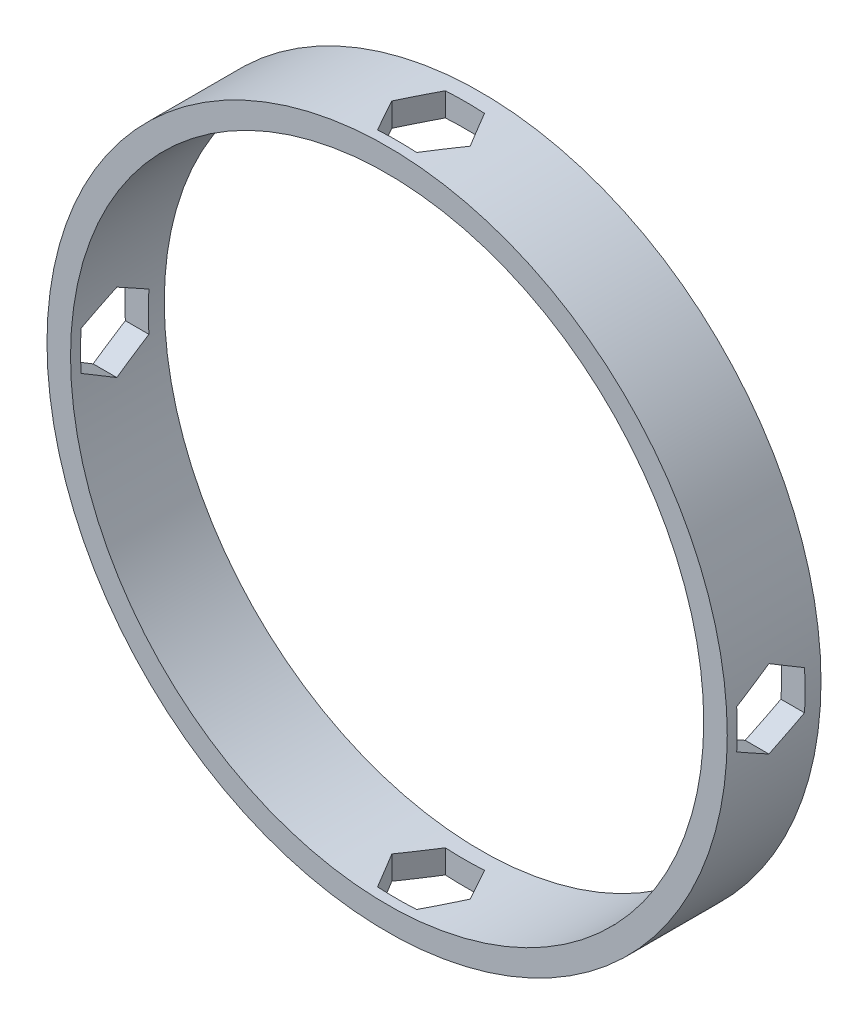
ISO-10303-21;
HEADER;
FILE_DESCRIPTION(('STEP AP214'),'2;1');
FILE_NAME('part.step','',(''),(''),'','','');
FILE_SCHEMA(('AUTOMOTIVE_DESIGN { 1 0 10303 214 1 1 1 1 }'));
ENDSEC;
DATA;
#1=APPLICATION_CONTEXT('core data for automotive mechanical design processes');
#2=APPLICATION_PROTOCOL_DEFINITION('international standard','automotive_design',2000,#1);
#3=PRODUCT_CONTEXT('',#1,'mechanical');
#4=PRODUCT('Part','Part','',(#3));
#5=PRODUCT_RELATED_PRODUCT_CATEGORY('part','',(#4));
#6=PRODUCT_DEFINITION_FORMATION('','',#4);
#7=PRODUCT_DEFINITION_CONTEXT('part definition',#1,'design');
#8=PRODUCT_DEFINITION('design','',#6,#7);
#9=PRODUCT_DEFINITION_SHAPE('','',#8);
#10=(LENGTH_UNIT() NAMED_UNIT(*) SI_UNIT(.MILLI.,.METRE.));
#11=(NAMED_UNIT(*) PLANE_ANGLE_UNIT() SI_UNIT($,.RADIAN.));
#12=(NAMED_UNIT(*) SI_UNIT($,.STERADIAN.) SOLID_ANGLE_UNIT());
#13=UNCERTAINTY_MEASURE_WITH_UNIT(LENGTH_MEASURE(1.E-05),#10,'distance_accuracy_value','');
#14=(GEOMETRIC_REPRESENTATION_CONTEXT(3) GLOBAL_UNCERTAINTY_ASSIGNED_CONTEXT((#13)) GLOBAL_UNIT_ASSIGNED_CONTEXT((#10,
#11,#12)) REPRESENTATION_CONTEXT('',''));
#15=CARTESIAN_POINT('',(0.,0.,0.));
#16=DIRECTION('',(0.,0.,1.));
#17=DIRECTION('',(1.,0.,0.));
#18=AXIS2_PLACEMENT_3D('',#15,#16,#17);
#19=CARTESIAN_POINT('',(0.,0.,9.4));
#20=DIRECTION('',(0.,0.,1.));
#21=DIRECTION('',(1.,0.,0.));
#22=AXIS2_PLACEMENT_3D('',#19,#20,#21);
#23=PLANE('',#22);
#24=CARTESIAN_POINT('',(0.,0.,9.4));
#25=DIRECTION('',(0.,0.,1.));
#26=DIRECTION('',(1.,0.,0.));
#27=AXIS2_PLACEMENT_3D('',#24,#25,#26);
#28=CIRCLE('',#27,34.11);
#29=CARTESIAN_POINT('',(34.11,0.,9.4));
#30=VERTEX_POINT('',#29);
#31=EDGE_CURVE('E332',#30,#30,#28,.T.);
#32=ORIENTED_EDGE('',*,*,#31,.T.);
#33=EDGE_LOOP('',(#32));
#34=FACE_BOUND('',#33,.T.);
#35=CARTESIAN_POINT('',(0.,0.,9.4));
#36=DIRECTION('',(0.,0.,1.));
#37=DIRECTION('',(1.,0.,0.));
#38=AXIS2_PLACEMENT_3D('',#35,#36,#37);
#39=CIRCLE('',#38,31.75);
#40=CARTESIAN_POINT('',(31.75,0.,9.4));
#41=VERTEX_POINT('',#40);
#42=EDGE_CURVE('E325',#41,#41,#39,.T.);
#43=ORIENTED_EDGE('',*,*,#42,.F.);
#44=EDGE_LOOP('',(#43));
#45=FACE_BOUND('',#44,.T.);
#46=ADVANCED_FACE('F43',(#34,#45),#23,.T.);
#47=CARTESIAN_POINT('',(0.,0.,0.));
#48=DIRECTION('',(0.,0.,1.));
#49=DIRECTION('',(1.,0.,0.));
#50=AXIS2_PLACEMENT_3D('',#47,#48,#49);
#51=PLANE('',#50);
#52=CARTESIAN_POINT('',(0.,0.,0.));
#53=DIRECTION('',(0.,0.,1.));
#54=DIRECTION('',(1.,0.,0.));
#55=AXIS2_PLACEMENT_3D('',#52,#53,#54);
#56=CIRCLE('',#55,34.11);
#57=CARTESIAN_POINT('',(34.11,0.,0.));
#58=VERTEX_POINT('',#57);
#59=EDGE_CURVE('E328',#58,#58,#56,.T.);
#60=ORIENTED_EDGE('',*,*,#59,.F.);
#61=EDGE_LOOP('',(#60));
#62=FACE_BOUND('',#61,.T.);
#63=CARTESIAN_POINT('',(0.,0.,0.));
#64=DIRECTION('',(0.,0.,1.));
#65=DIRECTION('',(1.,0.,0.));
#66=AXIS2_PLACEMENT_3D('',#63,#64,#65);
#67=CIRCLE('',#66,31.75);
#68=CARTESIAN_POINT('',(31.75,0.,0.));
#69=VERTEX_POINT('',#68);
#70=EDGE_CURVE('E329',#69,#69,#67,.T.);
#71=ORIENTED_EDGE('',*,*,#70,.T.);
#72=EDGE_LOOP('',(#71));
#73=FACE_BOUND('',#72,.T.);
#74=ADVANCED_FACE('F391',(#62,#73),#51,.F.);
#75=CARTESIAN_POINT('',(0.,0.,9.4));
#76=DIRECTION('',(0.,0.,-1.));
#77=DIRECTION('',(-1.,0.,0.));
#78=AXIS2_PLACEMENT_3D('',#75,#76,#77);
#79=CYLINDRICAL_SURFACE('',#78,34.11);
#80=CARTESIAN_POINT('',(0.,0.,11.8));
#81=DIRECTION('',(0.,0.866025403784438,0.5));
#82=DIRECTION('',(0.,0.5,-0.866025403784439));
#83=AXIS2_PLACEMENT_3D('',#80,#81,#82);
#84=ELLIPSE('',#83,68.22,34.11);
#85=CARTESIAN_POINT('',(34.053469231,1.96299091524485,8.4));
#86=VERTEX_POINT('',#85);
#87=CARTESIAN_POINT('',(33.8833110345885,3.92598183048957,5.00000000000002));
#88=VERTEX_POINT('',#87);
#89=EDGE_CURVE('E212',#86,#88,#84,.T.);
#90=ORIENTED_EDGE('',*,*,#89,.T.);
#91=CARTESIAN_POINT('',(0.,0.,-1.79999999999999));
#92=DIRECTION('',(0.,0.866025403784438,-0.500000000000001));
#93=DIRECTION('',(0.,-0.500000000000001,-0.866025403784438));
#94=AXIS2_PLACEMENT_3D('',#91,#92,#93);
#95=ELLIPSE('',#94,68.2199999999999,34.11);
#96=CARTESIAN_POINT('',(34.053469231,1.96299091524484,1.6));
#97=VERTEX_POINT('',#96);
#98=EDGE_CURVE('E59',#88,#97,#95,.T.);
#99=ORIENTED_EDGE('',*,*,#98,.T.);
#100=CARTESIAN_POINT('',(0.,0.,1.6));
#101=DIRECTION('',(0.,0.,-1.));
#102=DIRECTION('',(0.,-1.,0.));
#103=AXIS2_PLACEMENT_3D('',#100,#101,#102);
#104=CIRCLE('',#103,34.11);
#105=CARTESIAN_POINT('',(34.0534692310001,-1.96299091524461,1.6));
#106=VERTEX_POINT('',#105);
#107=EDGE_CURVE('E225',#97,#106,#104,.T.);
#108=ORIENTED_EDGE('',*,*,#107,.T.);
#109=CARTESIAN_POINT('',(0.,0.,-1.8));
#110=DIRECTION('',(0.,-0.866025403784439,-0.5));
#111=DIRECTION('',(0.,0.5,-0.866025403784439));
#112=AXIS2_PLACEMENT_3D('',#109,#110,#111);
#113=ELLIPSE('',#112,68.22,34.11);
#114=CARTESIAN_POINT('',(33.8833110345885,-3.92598183048934,5.));
#115=VERTEX_POINT('',#114);
#116=EDGE_CURVE('E687',#106,#115,#113,.T.);
#117=ORIENTED_EDGE('',*,*,#116,.T.);
#118=CARTESIAN_POINT('',(0.,0.,11.8));
#119=DIRECTION('',(0.,-0.866025403784439,0.5));
#120=DIRECTION('',(0.,-0.5,-0.866025403784439));
#121=AXIS2_PLACEMENT_3D('',#118,#119,#120);
#122=ELLIPSE('',#121,68.22,34.11);
#123=CARTESIAN_POINT('',(34.0534692310001,-1.96299091524461,8.4));
#124=VERTEX_POINT('',#123);
#125=EDGE_CURVE('E676',#115,#124,#122,.T.);
#126=ORIENTED_EDGE('',*,*,#125,.T.);
#127=CARTESIAN_POINT('',(0.,0.,8.4));
#128=DIRECTION('',(0.,0.,1.));
#129=DIRECTION('',(0.,1.,0.));
#130=AXIS2_PLACEMENT_3D('',#127,#128,#129);
#131=CIRCLE('',#130,34.11);
#132=EDGE_CURVE('E668',#124,#86,#131,.T.);
#133=ORIENTED_EDGE('',*,*,#132,.T.);
#134=EDGE_LOOP('',(#90,#99,#108,#117,#126,#133));
#135=FACE_BOUND('',#134,.T.);
#136=CARTESIAN_POINT('',(0.,0.,-1.79999999999999));
#137=DIRECTION('',(0.,0.866025403784438,-0.500000000000001));
#138=DIRECTION('',(0.,-0.500000000000001,-0.866025403784438));
#139=AXIS2_PLACEMENT_3D('',#136,#137,#138);
#140=ELLIPSE('',#139,68.2199999999999,34.11);
#141=CARTESIAN_POINT('',(-34.053469231,1.96299091524461,1.6));
#142=VERTEX_POINT('',#141);
#143=CARTESIAN_POINT('',(-33.8833110345885,3.92598183048934,5.));
#144=VERTEX_POINT('',#143);
#145=EDGE_CURVE('E234',#142,#144,#140,.T.);
#146=ORIENTED_EDGE('',*,*,#145,.T.);
#147=CARTESIAN_POINT('',(0.,0.,11.8));
#148=DIRECTION('',(0.,0.866025403784438,0.5));
#149=DIRECTION('',(0.,0.5,-0.866025403784439));
#150=AXIS2_PLACEMENT_3D('',#147,#148,#149);
#151=ELLIPSE('',#150,68.22,34.11);
#152=CARTESIAN_POINT('',(-34.0534692310001,1.96299091524461,8.4));
#153=VERTEX_POINT('',#152);
#154=EDGE_CURVE('E277',#144,#153,#151,.T.);
#155=ORIENTED_EDGE('',*,*,#154,.T.);
#156=CARTESIAN_POINT('',(0.,0.,8.4));
#157=DIRECTION('',(0.,0.,1.));
#158=DIRECTION('',(0.,1.,0.));
#159=AXIS2_PLACEMENT_3D('',#156,#157,#158);
#160=CIRCLE('',#159,34.11);
#161=CARTESIAN_POINT('',(-34.053469231,-1.96299091524484,8.4));
#162=VERTEX_POINT('',#161);
#163=EDGE_CURVE('E271',#153,#162,#160,.T.);
#164=ORIENTED_EDGE('',*,*,#163,.T.);
#165=CARTESIAN_POINT('',(0.,0.,11.8));
#166=DIRECTION('',(0.,-0.866025403784439,0.5));
#167=DIRECTION('',(0.,-0.5,-0.866025403784439));
#168=AXIS2_PLACEMENT_3D('',#165,#166,#167);
#169=ELLIPSE('',#168,68.22,34.11);
#170=CARTESIAN_POINT('',(-33.8833110345885,-3.92598183048957,5.));
#171=VERTEX_POINT('',#170);
#172=EDGE_CURVE('E263',#162,#171,#169,.T.);
#173=ORIENTED_EDGE('',*,*,#172,.T.);
#174=CARTESIAN_POINT('',(0.,0.,-1.8));
#175=DIRECTION('',(0.,-0.866025403784439,-0.5));
#176=DIRECTION('',(0.,0.5,-0.866025403784439));
#177=AXIS2_PLACEMENT_3D('',#174,#175,#176);
#178=ELLIPSE('',#177,68.22,34.11);
#179=CARTESIAN_POINT('',(-34.053469231,-1.96299091524485,1.6));
#180=VERTEX_POINT('',#179);
#181=EDGE_CURVE('E255',#171,#180,#178,.T.);
#182=ORIENTED_EDGE('',*,*,#181,.T.);
#183=CARTESIAN_POINT('',(0.,0.,1.6));
#184=DIRECTION('',(0.,0.,-1.));
#185=DIRECTION('',(0.,-1.,0.));
#186=AXIS2_PLACEMENT_3D('',#183,#184,#185);
#187=CIRCLE('',#186,34.11);
#188=EDGE_CURVE('E247',#180,#142,#187,.T.);
#189=ORIENTED_EDGE('',*,*,#188,.T.);
#190=EDGE_LOOP('',(#146,#155,#164,#173,#182,#189));
#191=FACE_BOUND('',#190,.T.);
#192=CARTESIAN_POINT('',(0.,0.,-1.79999999999999));
#193=DIRECTION('',(0.866025403784438,0.,-0.500000000000001));
#194=DIRECTION('',(-0.500000000000001,0.,-0.866025403784438));
#195=AXIS2_PLACEMENT_3D('',#192,#193,#194);
#196=ELLIPSE('',#195,68.2199999999999,34.11);
#197=CARTESIAN_POINT('',(3.92598183048946,-33.8833110345885,5.));
#198=VERTEX_POINT('',#197);
#199=CARTESIAN_POINT('',(1.96299091524472,-34.053469231,1.6));
#200=VERTEX_POINT('',#199);
#201=EDGE_CURVE('E303',#198,#200,#196,.T.);
#202=ORIENTED_EDGE('',*,*,#201,.T.);
#203=CARTESIAN_POINT('',(0.,0.,1.6));
#204=DIRECTION('',(0.,0.,-1.));
#205=DIRECTION('',(-1.,0.,0.));
#206=AXIS2_PLACEMENT_3D('',#203,#204,#205);
#207=CIRCLE('',#206,34.11);
#208=CARTESIAN_POINT('',(-1.96299091524473,-34.053469231,1.6));
#209=VERTEX_POINT('',#208);
#210=EDGE_CURVE('E310',#200,#209,#207,.T.);
#211=ORIENTED_EDGE('',*,*,#210,.T.);
#212=CARTESIAN_POINT('',(0.,0.,-1.8));
#213=DIRECTION('',(-0.866025403784439,0.,-0.5));
#214=DIRECTION('',(0.5,0.,-0.866025403784439));
#215=AXIS2_PLACEMENT_3D('',#212,#213,#214);
#216=ELLIPSE('',#215,68.22,34.11);
#217=CARTESIAN_POINT('',(-3.92598183048945,-33.8833110345885,5.));
#218=VERTEX_POINT('',#217);
#219=EDGE_CURVE('E313',#209,#218,#216,.T.);
#220=ORIENTED_EDGE('',*,*,#219,.T.);
#221=CARTESIAN_POINT('',(0.,0.,11.8));
#222=DIRECTION('',(-0.866025403784439,0.,0.5));
#223=DIRECTION('',(-0.5,0.,-0.866025403784439));
#224=AXIS2_PLACEMENT_3D('',#221,#222,#223);
#225=ELLIPSE('',#224,68.22,34.11);
#226=CARTESIAN_POINT('',(-1.96299091524473,-34.0534692310001,8.4));
#227=VERTEX_POINT('',#226);
#228=EDGE_CURVE('E317',#218,#227,#225,.T.);
#229=ORIENTED_EDGE('',*,*,#228,.T.);
#230=CARTESIAN_POINT('',(0.,0.,8.4));
#231=DIRECTION('',(0.,0.,1.));
#232=DIRECTION('',(1.,0.,0.));
#233=AXIS2_PLACEMENT_3D('',#230,#231,#232);
#234=CIRCLE('',#233,34.11);
#235=CARTESIAN_POINT('',(1.96299091524473,-34.053469231,8.4));
#236=VERTEX_POINT('',#235);
#237=EDGE_CURVE('E321',#227,#236,#234,.T.);
#238=ORIENTED_EDGE('',*,*,#237,.T.);
#239=CARTESIAN_POINT('',(0.,0.,11.8));
#240=DIRECTION('',(0.866025403784438,0.,0.5));
#241=DIRECTION('',(0.5,0.,-0.866025403784439));
#242=AXIS2_PLACEMENT_3D('',#239,#240,#241);
#243=ELLIPSE('',#242,68.22,34.11);
#244=EDGE_CURVE('E320',#236,#198,#243,.T.);
#245=ORIENTED_EDGE('',*,*,#244,.T.);
#246=EDGE_LOOP('',(#202,#211,#220,#229,#238,#245));
#247=FACE_BOUND('',#246,.T.);
#248=CARTESIAN_POINT('',(-3.92598183048945,33.8833110345885,5.));
#249=VERTEX_POINT('',#248);
#250=CARTESIAN_POINT('',(-1.96299091524473,34.053469231,1.6));
#251=VERTEX_POINT('',#250);
#252=EDGE_CURVE('E309',#249,#251,#216,.T.);
#253=ORIENTED_EDGE('',*,*,#252,.T.);
#254=CARTESIAN_POINT('',(1.96299091524472,34.053469231,1.6));
#255=VERTEX_POINT('',#254);
#256=EDGE_CURVE('E307',#251,#255,#207,.T.);
#257=ORIENTED_EDGE('',*,*,#256,.T.);
#258=CARTESIAN_POINT('',(3.92598183048946,33.8833110345885,5.));
#259=VERTEX_POINT('',#258);
#260=EDGE_CURVE('E306',#255,#259,#196,.T.);
#261=ORIENTED_EDGE('',*,*,#260,.T.);
#262=CARTESIAN_POINT('',(1.96299091524473,34.053469231,8.4));
#263=VERTEX_POINT('',#262);
#264=EDGE_CURVE('E324',#259,#263,#243,.T.);
#265=ORIENTED_EDGE('',*,*,#264,.T.);
#266=CARTESIAN_POINT('',(-1.96299091524473,34.053469231,8.4));
#267=VERTEX_POINT('',#266);
#268=EDGE_CURVE('E318',#263,#267,#234,.T.);
#269=ORIENTED_EDGE('',*,*,#268,.T.);
#270=EDGE_CURVE('E314',#267,#249,#225,.T.);
#271=ORIENTED_EDGE('',*,*,#270,.T.);
#272=EDGE_LOOP('',(#253,#257,#261,#265,#269,#271));
#273=FACE_BOUND('',#272,.T.);
#274=ORIENTED_EDGE('',*,*,#31,.F.);
#275=EDGE_LOOP('',(#274));
#276=FACE_BOUND('',#275,.T.);
#277=ORIENTED_EDGE('',*,*,#59,.T.);
#278=EDGE_LOOP('',(#277));
#279=FACE_BOUND('',#278,.T.);
#280=ADVANCED_FACE('F45',(#135,#191,#247,#273,#276,#279),#79,.T.);
#281=CARTESIAN_POINT('',(0.,0.,9.4));
#282=DIRECTION('',(0.,0.,-1.));
#283=DIRECTION('',(-1.,0.,0.));
#284=AXIS2_PLACEMENT_3D('',#281,#282,#283);
#285=CYLINDRICAL_SURFACE('',#284,31.75);
#286=CARTESIAN_POINT('',(0.,0.,-1.79999999999999));
#287=DIRECTION('',(0.,0.866025403784438,-0.500000000000001));
#288=DIRECTION('',(0.,-0.500000000000001,-0.866025403784438));
#289=AXIS2_PLACEMENT_3D('',#286,#287,#288);
#290=ELLIPSE('',#289,63.4999999999999,31.75);
#291=CARTESIAN_POINT('',(31.5063353417478,3.92598183048957,5.));
#292=VERTEX_POINT('',#291);
#293=CARTESIAN_POINT('',(31.6892594843532,1.96299091524484,1.6));
#294=VERTEX_POINT('',#293);
#295=EDGE_CURVE('E216',#292,#294,#290,.T.);
#296=ORIENTED_EDGE('',*,*,#295,.F.);
#297=CARTESIAN_POINT('',(0.,0.,11.8));
#298=DIRECTION('',(0.,0.866025403784438,0.5));
#299=DIRECTION('',(0.,0.5,-0.866025403784439));
#300=AXIS2_PLACEMENT_3D('',#297,#298,#299);
#301=ELLIPSE('',#300,63.5,31.75);
#302=CARTESIAN_POINT('',(31.6892594843532,1.96299091524484,8.4));
#303=VERTEX_POINT('',#302);
#304=EDGE_CURVE('E205',#303,#292,#301,.T.);
#305=ORIENTED_EDGE('',*,*,#304,.F.);
#306=CARTESIAN_POINT('',(0.,0.,8.4));
#307=DIRECTION('',(0.,0.,1.));
#308=DIRECTION('',(0.,1.,0.));
#309=AXIS2_PLACEMENT_3D('',#306,#307,#308);
#310=CIRCLE('',#309,31.75);
#311=CARTESIAN_POINT('',(31.6892594843532,-1.96299091524462,8.4));
#312=VERTEX_POINT('',#311);
#313=EDGE_CURVE('E67',#312,#303,#310,.T.);
#314=ORIENTED_EDGE('',*,*,#313,.F.);
#315=CARTESIAN_POINT('',(0.,0.,11.8));
#316=DIRECTION('',(0.,-0.866025403784439,0.5));
#317=DIRECTION('',(0.,-0.5,-0.866025403784439));
#318=AXIS2_PLACEMENT_3D('',#315,#316,#317);
#319=ELLIPSE('',#318,63.5,31.75);
#320=CARTESIAN_POINT('',(31.5063353417478,-3.92598183048934,5.));
#321=VERTEX_POINT('',#320);
#322=EDGE_CURVE('E673',#321,#312,#319,.T.);
#323=ORIENTED_EDGE('',*,*,#322,.F.);
#324=CARTESIAN_POINT('',(0.,0.,-1.8));
#325=DIRECTION('',(0.,-0.866025403784439,-0.5));
#326=DIRECTION('',(0.,0.5,-0.866025403784439));
#327=AXIS2_PLACEMENT_3D('',#324,#325,#326);
#328=ELLIPSE('',#327,63.5,31.75);
#329=CARTESIAN_POINT('',(31.6892594843532,-1.96299091524462,1.6));
#330=VERTEX_POINT('',#329);
#331=EDGE_CURVE('E685',#330,#321,#328,.T.);
#332=ORIENTED_EDGE('',*,*,#331,.F.);
#333=CARTESIAN_POINT('',(0.,0.,1.6));
#334=DIRECTION('',(0.,0.,-1.));
#335=DIRECTION('',(0.,-1.,0.));
#336=AXIS2_PLACEMENT_3D('',#333,#334,#335);
#337=CIRCLE('',#336,31.75);
#338=EDGE_CURVE('E224',#294,#330,#337,.T.);
#339=ORIENTED_EDGE('',*,*,#338,.F.);
#340=EDGE_LOOP('',(#296,#305,#314,#323,#332,#339));
#341=FACE_BOUND('',#340,.T.);
#342=CARTESIAN_POINT('',(0.,0.,11.8));
#343=DIRECTION('',(0.,0.866025403784438,0.5));
#344=DIRECTION('',(0.,0.5,-0.866025403784439));
#345=AXIS2_PLACEMENT_3D('',#342,#343,#344);
#346=ELLIPSE('',#345,63.5,31.75);
#347=CARTESIAN_POINT('',(-31.5063353417478,3.92598183048935,5.));
#348=VERTEX_POINT('',#347);
#349=CARTESIAN_POINT('',(-31.6892594843532,1.96299091524462,8.4));
#350=VERTEX_POINT('',#349);
#351=EDGE_CURVE('E274',#348,#350,#346,.T.);
#352=ORIENTED_EDGE('',*,*,#351,.F.);
#353=CARTESIAN_POINT('',(0.,0.,-1.79999999999999));
#354=DIRECTION('',(0.,0.866025403784438,-0.500000000000001));
#355=DIRECTION('',(0.,-0.500000000000001,-0.866025403784438));
#356=AXIS2_PLACEMENT_3D('',#353,#354,#355);
#357=ELLIPSE('',#356,63.4999999999999,31.75);
#358=CARTESIAN_POINT('',(-31.6892594843532,1.96299091524461,1.6));
#359=VERTEX_POINT('',#358);
#360=EDGE_CURVE('E227',#359,#348,#357,.T.);
#361=ORIENTED_EDGE('',*,*,#360,.F.);
#362=CARTESIAN_POINT('',(0.,0.,1.6));
#363=DIRECTION('',(0.,0.,-1.));
#364=DIRECTION('',(0.,-1.,0.));
#365=AXIS2_PLACEMENT_3D('',#362,#363,#364);
#366=CIRCLE('',#365,31.75);
#367=CARTESIAN_POINT('',(-31.6892594843532,-1.96299091524484,1.6));
#368=VERTEX_POINT('',#367);
#369=EDGE_CURVE('E245',#368,#359,#366,.T.);
#370=ORIENTED_EDGE('',*,*,#369,.F.);
#371=CARTESIAN_POINT('',(0.,0.,-1.8));
#372=DIRECTION('',(0.,-0.866025403784439,-0.5));
#373=DIRECTION('',(0.,0.5,-0.866025403784439));
#374=AXIS2_PLACEMENT_3D('',#371,#372,#373);
#375=ELLIPSE('',#374,63.5,31.75);
#376=CARTESIAN_POINT('',(-31.5063353417478,-3.92598183048956,5.));
#377=VERTEX_POINT('',#376);
#378=EDGE_CURVE('E252',#377,#368,#375,.T.);
#379=ORIENTED_EDGE('',*,*,#378,.F.);
#380=CARTESIAN_POINT('',(0.,0.,11.8));
#381=DIRECTION('',(0.,-0.866025403784439,0.5));
#382=DIRECTION('',(0.,-0.5,-0.866025403784439));
#383=AXIS2_PLACEMENT_3D('',#380,#381,#382);
#384=ELLIPSE('',#383,63.5,31.75);
#385=CARTESIAN_POINT('',(-31.6892594843532,-1.96299091524484,8.4));
#386=VERTEX_POINT('',#385);
#387=EDGE_CURVE('E260',#386,#377,#384,.T.);
#388=ORIENTED_EDGE('',*,*,#387,.F.);
#389=CARTESIAN_POINT('',(0.,0.,8.4));
#390=DIRECTION('',(0.,0.,1.));
#391=DIRECTION('',(0.,1.,0.));
#392=AXIS2_PLACEMENT_3D('',#389,#390,#391);
#393=CIRCLE('',#392,31.75);
#394=EDGE_CURVE('E268',#350,#386,#393,.T.);
#395=ORIENTED_EDGE('',*,*,#394,.F.);
#396=EDGE_LOOP('',(#352,#361,#370,#379,#388,#395));
#397=FACE_BOUND('',#396,.T.);
#398=CARTESIAN_POINT('',(0.,0.,11.8));
#399=DIRECTION('',(0.866025403784438,0.,0.5));
#400=DIRECTION('',(0.5,0.,-0.866025403784439));
#401=AXIS2_PLACEMENT_3D('',#398,#399,#400);
#402=ELLIPSE('',#401,63.5,31.75);
#403=CARTESIAN_POINT('',(3.92598183048946,31.5063353417478,5.));
#404=VERTEX_POINT('',#403);
#405=CARTESIAN_POINT('',(1.96299091524473,31.6892594843532,8.4));
#406=VERTEX_POINT('',#405);
#407=EDGE_CURVE('E11',#404,#406,#402,.T.);
#408=ORIENTED_EDGE('',*,*,#407,.F.);
#409=CARTESIAN_POINT('',(0.,0.,-1.79999999999999));
#410=DIRECTION('',(0.866025403784438,0.,-0.500000000000001));
#411=DIRECTION('',(-0.500000000000001,0.,-0.866025403784438));
#412=AXIS2_PLACEMENT_3D('',#409,#410,#411);
#413=ELLIPSE('',#412,63.4999999999999,31.75);
#414=CARTESIAN_POINT('',(1.96299091524472,31.6892594843532,1.6));
#415=VERTEX_POINT('',#414);
#416=EDGE_CURVE('E340',#415,#404,#413,.T.);
#417=ORIENTED_EDGE('',*,*,#416,.F.);
#418=CARTESIAN_POINT('',(0.,0.,1.6));
#419=DIRECTION('',(0.,0.,-1.));
#420=DIRECTION('',(-1.,0.,0.));
#421=AXIS2_PLACEMENT_3D('',#418,#419,#420);
#422=CIRCLE('',#421,31.75);
#423=CARTESIAN_POINT('',(-1.96299091524473,31.6892594843532,1.6));
#424=VERTEX_POINT('',#423);
#425=EDGE_CURVE('E343',#424,#415,#422,.T.);
#426=ORIENTED_EDGE('',*,*,#425,.F.);
#427=CARTESIAN_POINT('',(0.,0.,-1.8));
#428=DIRECTION('',(-0.866025403784439,0.,-0.5));
#429=DIRECTION('',(0.5,0.,-0.866025403784439));
#430=AXIS2_PLACEMENT_3D('',#427,#428,#429);
#431=ELLIPSE('',#430,63.5,31.75);
#432=CARTESIAN_POINT('',(-3.92598183048945,31.5063353417478,5.));
#433=VERTEX_POINT('',#432);
#434=EDGE_CURVE('E346',#433,#424,#431,.T.);
#435=ORIENTED_EDGE('',*,*,#434,.F.);
#436=CARTESIAN_POINT('',(0.,0.,11.8));
#437=DIRECTION('',(-0.866025403784439,0.,0.5));
#438=DIRECTION('',(-0.5,0.,-0.866025403784439));
#439=AXIS2_PLACEMENT_3D('',#436,#437,#438);
#440=ELLIPSE('',#439,63.5,31.75);
#441=CARTESIAN_POINT('',(-1.96299091524473,31.6892594843532,8.4));
#442=VERTEX_POINT('',#441);
#443=EDGE_CURVE('E348',#442,#433,#440,.T.);
#444=ORIENTED_EDGE('',*,*,#443,.F.);
#445=CARTESIAN_POINT('',(0.,0.,8.4));
#446=DIRECTION('',(0.,0.,1.));
#447=DIRECTION('',(1.,0.,0.));
#448=AXIS2_PLACEMENT_3D('',#445,#446,#447);
#449=CIRCLE('',#448,31.75);
#450=EDGE_CURVE('E52',#406,#442,#449,.T.);
#451=ORIENTED_EDGE('',*,*,#450,.F.);
#452=EDGE_LOOP('',(#408,#417,#426,#435,#444,#451));
#453=FACE_BOUND('',#452,.T.);
#454=CARTESIAN_POINT('',(1.96299091524473,-31.6892594843532,8.4));
#455=VERTEX_POINT('',#454);
#456=CARTESIAN_POINT('',(3.92598183048946,-31.5063353417478,5.));
#457=VERTEX_POINT('',#456);
#458=EDGE_CURVE('E47',#455,#457,#402,.T.);
#459=ORIENTED_EDGE('',*,*,#458,.F.);
#460=CARTESIAN_POINT('',(-1.96299091524473,-31.6892594843532,8.4));
#461=VERTEX_POINT('',#460);
#462=EDGE_CURVE('E347',#461,#455,#449,.T.);
#463=ORIENTED_EDGE('',*,*,#462,.F.);
#464=CARTESIAN_POINT('',(-3.92598183048945,-31.5063353417478,5.));
#465=VERTEX_POINT('',#464);
#466=EDGE_CURVE('E345',#465,#461,#440,.T.);
#467=ORIENTED_EDGE('',*,*,#466,.F.);
#468=CARTESIAN_POINT('',(-1.96299091524473,-31.6892594843532,1.6));
#469=VERTEX_POINT('',#468);
#470=EDGE_CURVE('E342',#469,#465,#431,.T.);
#471=ORIENTED_EDGE('',*,*,#470,.F.);
#472=CARTESIAN_POINT('',(1.96299091524472,-31.6892594843532,1.6));
#473=VERTEX_POINT('',#472);
#474=EDGE_CURVE('E339',#473,#469,#422,.T.);
#475=ORIENTED_EDGE('',*,*,#474,.F.);
#476=EDGE_CURVE('E335',#457,#473,#413,.T.);
#477=ORIENTED_EDGE('',*,*,#476,.F.);
#478=EDGE_LOOP('',(#459,#463,#467,#471,#475,#477));
#479=FACE_BOUND('',#478,.T.);
#480=ORIENTED_EDGE('',*,*,#42,.T.);
#481=EDGE_LOOP('',(#480));
#482=FACE_BOUND('',#481,.T.);
#483=ORIENTED_EDGE('',*,*,#70,.F.);
#484=EDGE_LOOP('',(#483));
#485=FACE_BOUND('',#484,.T.);
#486=ADVANCED_FACE('F220',(#341,#397,#453,#479,#482,#485),#285,.F.);
#487=CARTESIAN_POINT('',(3.92598183048946,-34.11,5.));
#488=DIRECTION('',(0.866025403784438,0.,-0.500000000000001));
#489=DIRECTION('',(-0.500000000000001,0.,-0.866025403784438));
#490=AXIS2_PLACEMENT_3D('',#487,#488,#489);
#491=PLANE('',#490);
#492=DIRECTION('',(0.,1.,0.));
#493=VECTOR('',#492,1.);
#494=CARTESIAN_POINT('',(3.92598183048946,-34.11,5.));
#495=LINE('',#494,#493);
#496=EDGE_CURVE('E301',#198,#457,#495,.T.);
#497=ORIENTED_EDGE('',*,*,#496,.T.);
#498=ORIENTED_EDGE('',*,*,#476,.T.);
#499=DIRECTION('',(0.,1.,0.));
#500=VECTOR('',#499,1.);
#501=CARTESIAN_POINT('',(1.96299091524472,-34.11,1.6));
#502=LINE('',#501,#500);
#503=EDGE_CURVE('E297',#200,#473,#502,.T.);
#504=ORIENTED_EDGE('',*,*,#503,.F.);
#505=ORIENTED_EDGE('',*,*,#201,.F.);
#506=EDGE_LOOP('',(#497,#498,#504,#505));
#507=FACE_BOUND('',#506,.T.);
#508=ADVANCED_FACE('F382',(#507),#491,.F.);
#509=CARTESIAN_POINT('',(1.96299091524472,-34.11,1.6));
#510=DIRECTION('',(0.,0.,-1.));
#511=DIRECTION('',(-1.,0.,0.));
#512=AXIS2_PLACEMENT_3D('',#509,#510,#511);
#513=PLANE('',#512);
#514=ORIENTED_EDGE('',*,*,#503,.T.);
#515=ORIENTED_EDGE('',*,*,#474,.T.);
#516=DIRECTION('',(0.,1.,0.));
#517=VECTOR('',#516,1.);
#518=CARTESIAN_POINT('',(-1.96299091524473,-34.11,1.6));
#519=LINE('',#518,#517);
#520=EDGE_CURVE('E293',#209,#469,#519,.T.);
#521=ORIENTED_EDGE('',*,*,#520,.F.);
#522=ORIENTED_EDGE('',*,*,#210,.F.);
#523=EDGE_LOOP('',(#514,#515,#521,#522));
#524=FACE_BOUND('',#523,.T.);
#525=ADVANCED_FACE('F415',(#524),#513,.F.);
#526=CARTESIAN_POINT('',(-1.96299091524473,-34.11,1.6));
#527=DIRECTION('',(-0.866025403784439,0.,-0.5));
#528=DIRECTION('',(-0.5,0.,0.866025403784439));
#529=AXIS2_PLACEMENT_3D('',#526,#527,#528);
#530=PLANE('',#529);
#531=ORIENTED_EDGE('',*,*,#520,.T.);
#532=ORIENTED_EDGE('',*,*,#470,.T.);
#533=DIRECTION('',(0.,1.,0.));
#534=VECTOR('',#533,1.);
#535=CARTESIAN_POINT('',(-3.92598183048945,-34.11,5.));
#536=LINE('',#535,#534);
#537=EDGE_CURVE('E289',#218,#465,#536,.T.);
#538=ORIENTED_EDGE('',*,*,#537,.F.);
#539=ORIENTED_EDGE('',*,*,#219,.F.);
#540=EDGE_LOOP('',(#531,#532,#538,#539));
#541=FACE_BOUND('',#540,.T.);
#542=ADVANCED_FACE('F416',(#541),#530,.F.);
#543=CARTESIAN_POINT('',(-3.92598183048945,-34.11,5.));
#544=DIRECTION('',(-0.866025403784439,0.,0.5));
#545=DIRECTION('',(0.5,0.,0.866025403784439));
#546=AXIS2_PLACEMENT_3D('',#543,#544,#545);
#547=PLANE('',#546);
#548=ORIENTED_EDGE('',*,*,#537,.T.);
#549=ORIENTED_EDGE('',*,*,#466,.T.);
#550=DIRECTION('',(0.,1.,0.));
#551=VECTOR('',#550,1.);
#552=CARTESIAN_POINT('',(-1.96299091524473,-34.11,8.4));
#553=LINE('',#552,#551);
#554=EDGE_CURVE('E285',#227,#461,#553,.T.);
#555=ORIENTED_EDGE('',*,*,#554,.F.);
#556=ORIENTED_EDGE('',*,*,#228,.F.);
#557=EDGE_LOOP('',(#548,#549,#555,#556));
#558=FACE_BOUND('',#557,.T.);
#559=ADVANCED_FACE('F419',(#558),#547,.F.);
#560=CARTESIAN_POINT('',(-1.96299091524473,-34.11,8.4));
#561=DIRECTION('',(0.,0.,1.));
#562=DIRECTION('',(1.,0.,0.));
#563=AXIS2_PLACEMENT_3D('',#560,#561,#562);
#564=PLANE('',#563);
#565=ORIENTED_EDGE('',*,*,#554,.T.);
#566=ORIENTED_EDGE('',*,*,#462,.T.);
#567=DIRECTION('',(0.,1.,0.));
#568=VECTOR('',#567,1.);
#569=CARTESIAN_POINT('',(1.96299091524473,-34.11,8.4));
#570=LINE('',#569,#568);
#571=EDGE_CURVE('E284',#236,#455,#570,.T.);
#572=ORIENTED_EDGE('',*,*,#571,.F.);
#573=ORIENTED_EDGE('',*,*,#237,.F.);
#574=EDGE_LOOP('',(#565,#566,#572,#573));
#575=FACE_BOUND('',#574,.T.);
#576=ADVANCED_FACE('F423',(#575),#564,.F.);
#577=CARTESIAN_POINT('',(1.96299091524473,-34.11,8.4));
#578=DIRECTION('',(0.866025403784438,0.,0.5));
#579=DIRECTION('',(0.5,0.,-0.866025403784439));
#580=AXIS2_PLACEMENT_3D('',#577,#578,#579);
#581=PLANE('',#580);
#582=ORIENTED_EDGE('',*,*,#571,.T.);
#583=ORIENTED_EDGE('',*,*,#458,.T.);
#584=ORIENTED_EDGE('',*,*,#496,.F.);
#585=ORIENTED_EDGE('',*,*,#244,.F.);
#586=EDGE_LOOP('',(#582,#583,#584,#585));
#587=FACE_BOUND('',#586,.T.);
#588=ADVANCED_FACE('F407',(#587),#581,.F.);
#589=EDGE_CURVE('E280',#404,#259,#495,.T.);
#590=ORIENTED_EDGE('',*,*,#589,.F.);
#591=ORIENTED_EDGE('',*,*,#407,.T.);
#592=EDGE_CURVE('E281',#406,#263,#570,.T.);
#593=ORIENTED_EDGE('',*,*,#592,.T.);
#594=ORIENTED_EDGE('',*,*,#264,.F.);
#595=EDGE_LOOP('',(#590,#591,#593,#594));
#596=FACE_BOUND('',#595,.T.);
#597=ADVANCED_FACE('F377',(#596),#581,.F.);
#598=ORIENTED_EDGE('',*,*,#592,.F.);
#599=ORIENTED_EDGE('',*,*,#450,.T.);
#600=EDGE_CURVE('E286',#442,#267,#553,.T.);
#601=ORIENTED_EDGE('',*,*,#600,.T.);
#602=ORIENTED_EDGE('',*,*,#268,.F.);
#603=EDGE_LOOP('',(#598,#599,#601,#602));
#604=FACE_BOUND('',#603,.T.);
#605=ADVANCED_FACE('F406',(#604),#564,.F.);
#606=ORIENTED_EDGE('',*,*,#600,.F.);
#607=ORIENTED_EDGE('',*,*,#443,.T.);
#608=EDGE_CURVE('E290',#433,#249,#536,.T.);
#609=ORIENTED_EDGE('',*,*,#608,.T.);
#610=ORIENTED_EDGE('',*,*,#270,.F.);
#611=EDGE_LOOP('',(#606,#607,#609,#610));
#612=FACE_BOUND('',#611,.T.);
#613=ADVANCED_FACE('F425',(#612),#547,.F.);
#614=ORIENTED_EDGE('',*,*,#608,.F.);
#615=ORIENTED_EDGE('',*,*,#434,.T.);
#616=EDGE_CURVE('E294',#424,#251,#519,.T.);
#617=ORIENTED_EDGE('',*,*,#616,.T.);
#618=ORIENTED_EDGE('',*,*,#252,.F.);
#619=EDGE_LOOP('',(#614,#615,#617,#618));
#620=FACE_BOUND('',#619,.T.);
#621=ADVANCED_FACE('F414',(#620),#530,.F.);
#622=ORIENTED_EDGE('',*,*,#616,.F.);
#623=ORIENTED_EDGE('',*,*,#425,.T.);
#624=EDGE_CURVE('E298',#415,#255,#502,.T.);
#625=ORIENTED_EDGE('',*,*,#624,.T.);
#626=ORIENTED_EDGE('',*,*,#256,.F.);
#627=EDGE_LOOP('',(#622,#623,#625,#626));
#628=FACE_BOUND('',#627,.T.);
#629=ADVANCED_FACE('F411',(#628),#513,.F.);
#630=ORIENTED_EDGE('',*,*,#624,.F.);
#631=ORIENTED_EDGE('',*,*,#416,.T.);
#632=ORIENTED_EDGE('',*,*,#589,.T.);
#633=ORIENTED_EDGE('',*,*,#260,.F.);
#634=EDGE_LOOP('',(#630,#631,#632,#633));
#635=FACE_BOUND('',#634,.T.);
#636=ADVANCED_FACE('F371',(#635),#491,.F.);
#637=CARTESIAN_POINT('',(34.11,1.96299091524485,8.4));
#638=DIRECTION('',(0.,0.866025403784438,0.5));
#639=DIRECTION('',(0.,0.5,-0.866025403784439));
#640=AXIS2_PLACEMENT_3D('',#637,#638,#639);
#641=PLANE('',#640);
#642=DIRECTION('',(-1.,0.,0.));
#643=VECTOR('',#642,1.);
#644=CARTESIAN_POINT('',(34.11,3.92598183048958,5.));
#645=LINE('',#644,#643);
#646=EDGE_CURVE('E240',#348,#144,#645,.T.);
#647=ORIENTED_EDGE('',*,*,#646,.F.);
#648=ORIENTED_EDGE('',*,*,#351,.T.);
#649=DIRECTION('',(-1.,0.,0.));
#650=VECTOR('',#649,1.);
#651=CARTESIAN_POINT('',(34.11,1.96299091524485,8.4));
#652=LINE('',#651,#650);
#653=EDGE_CURVE('E266',#350,#153,#652,.T.);
#654=ORIENTED_EDGE('',*,*,#653,.T.);
#655=ORIENTED_EDGE('',*,*,#154,.F.);
#656=EDGE_LOOP('',(#647,#648,#654,#655));
#657=FACE_BOUND('',#656,.T.);
#658=ADVANCED_FACE('F410',(#657),#641,.F.);
#659=CARTESIAN_POINT('',(34.11,-1.96299091524461,8.4));
#660=DIRECTION('',(0.,0.,1.));
#661=DIRECTION('',(0.,1.,0.));
#662=AXIS2_PLACEMENT_3D('',#659,#660,#661);
#663=PLANE('',#662);
#664=ORIENTED_EDGE('',*,*,#653,.F.);
#665=ORIENTED_EDGE('',*,*,#394,.T.);
#666=DIRECTION('',(-1.,0.,0.));
#667=VECTOR('',#666,1.);
#668=CARTESIAN_POINT('',(34.11,-1.96299091524461,8.4));
#669=LINE('',#668,#667);
#670=EDGE_CURVE('E258',#386,#162,#669,.T.);
#671=ORIENTED_EDGE('',*,*,#670,.T.);
#672=ORIENTED_EDGE('',*,*,#163,.F.);
#673=EDGE_LOOP('',(#664,#665,#671,#672));
#674=FACE_BOUND('',#673,.T.);
#675=ADVANCED_FACE('F430',(#674),#663,.F.);
#676=CARTESIAN_POINT('',(34.11,-3.92598183048933,5.));
#677=DIRECTION('',(0.,-0.866025403784439,0.5));
#678=DIRECTION('',(0.,0.5,0.866025403784439));
#679=AXIS2_PLACEMENT_3D('',#676,#677,#678);
#680=PLANE('',#679);
#681=ORIENTED_EDGE('',*,*,#670,.F.);
#682=ORIENTED_EDGE('',*,*,#387,.T.);
#683=DIRECTION('',(-1.,0.,0.));
#684=VECTOR('',#683,1.);
#685=CARTESIAN_POINT('',(34.11,-3.92598183048933,5.));
#686=LINE('',#685,#684);
#687=EDGE_CURVE('E250',#377,#171,#686,.T.);
#688=ORIENTED_EDGE('',*,*,#687,.T.);
#689=ORIENTED_EDGE('',*,*,#172,.F.);
#690=EDGE_LOOP('',(#681,#682,#688,#689));
#691=FACE_BOUND('',#690,.T.);
#692=ADVANCED_FACE('F434',(#691),#680,.F.);
#693=CARTESIAN_POINT('',(34.11,-1.96299091524461,1.6));
#694=DIRECTION('',(0.,-0.866025403784439,-0.5));
#695=DIRECTION('',(0.,-0.5,0.866025403784439));
#696=AXIS2_PLACEMENT_3D('',#693,#694,#695);
#697=PLANE('',#696);
#698=ORIENTED_EDGE('',*,*,#687,.F.);
#699=ORIENTED_EDGE('',*,*,#378,.T.);
#700=DIRECTION('',(-1.,0.,0.));
#701=VECTOR('',#700,1.);
#702=CARTESIAN_POINT('',(34.11,-1.96299091524461,1.6));
#703=LINE('',#702,#701);
#704=EDGE_CURVE('E243',#368,#180,#703,.T.);
#705=ORIENTED_EDGE('',*,*,#704,.T.);
#706=ORIENTED_EDGE('',*,*,#181,.F.);
#707=EDGE_LOOP('',(#698,#699,#705,#706));
#708=FACE_BOUND('',#707,.T.);
#709=ADVANCED_FACE('F438',(#708),#697,.F.);
#710=CARTESIAN_POINT('',(34.11,1.96299091524484,1.6));
#711=DIRECTION('',(0.,0.,-1.));
#712=DIRECTION('',(0.,-1.,0.));
#713=AXIS2_PLACEMENT_3D('',#710,#711,#712);
#714=PLANE('',#713);
#715=ORIENTED_EDGE('',*,*,#704,.F.);
#716=ORIENTED_EDGE('',*,*,#369,.T.);
#717=DIRECTION('',(-1.,0.,0.));
#718=VECTOR('',#717,1.);
#719=CARTESIAN_POINT('',(34.11,1.96299091524484,1.6));
#720=LINE('',#719,#718);
#721=EDGE_CURVE('E237',#359,#142,#720,.T.);
#722=ORIENTED_EDGE('',*,*,#721,.T.);
#723=ORIENTED_EDGE('',*,*,#188,.F.);
#724=EDGE_LOOP('',(#715,#716,#722,#723));
#725=FACE_BOUND('',#724,.T.);
#726=ADVANCED_FACE('F442',(#725),#714,.F.);
#727=CARTESIAN_POINT('',(34.11,3.92598183048958,5.));
#728=DIRECTION('',(0.,0.866025403784438,-0.500000000000001));
#729=DIRECTION('',(0.,-0.500000000000001,-0.866025403784438));
#730=AXIS2_PLACEMENT_3D('',#727,#728,#729);
#731=PLANE('',#730);
#732=ORIENTED_EDGE('',*,*,#721,.F.);
#733=ORIENTED_EDGE('',*,*,#360,.T.);
#734=ORIENTED_EDGE('',*,*,#646,.T.);
#735=ORIENTED_EDGE('',*,*,#145,.F.);
#736=EDGE_LOOP('',(#732,#733,#734,#735));
#737=FACE_BOUND('',#736,.T.);
#738=ADVANCED_FACE('F446',(#737),#731,.F.);
#739=CARTESIAN_POINT('',(34.11,3.92598183048958,5.));
#740=DIRECTION('',(0.,0.866025403784438,-0.500000000000001));
#741=DIRECTION('',(0.,-0.500000000000001,-0.866025403784438));
#742=AXIS2_PLACEMENT_3D('',#739,#740,#741);
#743=PLANE('',#742);
#744=DIRECTION('',(-1.,0.,0.));
#745=VECTOR('',#744,1.);
#746=CARTESIAN_POINT('',(34.11,3.92598183048958,5.));
#747=LINE('',#746,#745);
#748=EDGE_CURVE('E207',#88,#292,#747,.T.);
#749=ORIENTED_EDGE('',*,*,#748,.T.);
#750=ORIENTED_EDGE('',*,*,#295,.T.);
#751=DIRECTION('',(-1.,0.,0.));
#752=VECTOR('',#751,1.);
#753=CARTESIAN_POINT('',(34.11,1.96299091524484,1.6));
#754=LINE('',#753,#752);
#755=EDGE_CURVE('E690',#97,#294,#754,.T.);
#756=ORIENTED_EDGE('',*,*,#755,.F.);
#757=ORIENTED_EDGE('',*,*,#98,.F.);
#758=EDGE_LOOP('',(#749,#750,#756,#757));
#759=FACE_BOUND('',#758,.T.);
#760=ADVANCED_FACE('F215',(#759),#743,.F.);
#761=CARTESIAN_POINT('',(34.11,1.96299091524484,1.6));
#762=DIRECTION('',(0.,0.,-1.));
#763=DIRECTION('',(0.,-1.,0.));
#764=AXIS2_PLACEMENT_3D('',#761,#762,#763);
#765=PLANE('',#764);
#766=ORIENTED_EDGE('',*,*,#755,.T.);
#767=ORIENTED_EDGE('',*,*,#338,.T.);
#768=DIRECTION('',(-1.,0.,0.));
#769=VECTOR('',#768,1.);
#770=CARTESIAN_POINT('',(34.11,-1.96299091524461,1.6));
#771=LINE('',#770,#769);
#772=EDGE_CURVE('E683',#106,#330,#771,.T.);
#773=ORIENTED_EDGE('',*,*,#772,.F.);
#774=ORIENTED_EDGE('',*,*,#107,.F.);
#775=EDGE_LOOP('',(#766,#767,#773,#774));
#776=FACE_BOUND('',#775,.T.);
#777=ADVANCED_FACE('F453',(#776),#765,.F.);
#778=CARTESIAN_POINT('',(34.11,-1.96299091524461,1.6));
#779=DIRECTION('',(0.,-0.866025403784439,-0.5));
#780=DIRECTION('',(0.,-0.5,0.866025403784439));
#781=AXIS2_PLACEMENT_3D('',#778,#779,#780);
#782=PLANE('',#781);
#783=ORIENTED_EDGE('',*,*,#772,.T.);
#784=ORIENTED_EDGE('',*,*,#331,.T.);
#785=DIRECTION('',(-1.,0.,0.));
#786=VECTOR('',#785,1.);
#787=CARTESIAN_POINT('',(34.11,-3.92598183048933,5.));
#788=LINE('',#787,#786);
#789=EDGE_CURVE('E674',#115,#321,#788,.T.);
#790=ORIENTED_EDGE('',*,*,#789,.F.);
#791=ORIENTED_EDGE('',*,*,#116,.F.);
#792=EDGE_LOOP('',(#783,#784,#790,#791));
#793=FACE_BOUND('',#792,.T.);
#794=ADVANCED_FACE('F456',(#793),#782,.F.);
#795=CARTESIAN_POINT('',(34.11,-3.92598183048933,5.));
#796=DIRECTION('',(0.,-0.866025403784439,0.5));
#797=DIRECTION('',(0.,0.5,0.866025403784439));
#798=AXIS2_PLACEMENT_3D('',#795,#796,#797);
#799=PLANE('',#798);
#800=ORIENTED_EDGE('',*,*,#789,.T.);
#801=ORIENTED_EDGE('',*,*,#322,.T.);
#802=DIRECTION('',(-1.,0.,0.));
#803=VECTOR('',#802,1.);
#804=CARTESIAN_POINT('',(34.11,-1.96299091524461,8.4));
#805=LINE('',#804,#803);
#806=EDGE_CURVE('E218',#124,#312,#805,.T.);
#807=ORIENTED_EDGE('',*,*,#806,.F.);
#808=ORIENTED_EDGE('',*,*,#125,.F.);
#809=EDGE_LOOP('',(#800,#801,#807,#808));
#810=FACE_BOUND('',#809,.T.);
#811=ADVANCED_FACE('F460',(#810),#799,.F.);
#812=CARTESIAN_POINT('',(34.11,-1.96299091524461,8.4));
#813=DIRECTION('',(0.,0.,1.));
#814=DIRECTION('',(0.,1.,0.));
#815=AXIS2_PLACEMENT_3D('',#812,#813,#814);
#816=PLANE('',#815);
#817=ORIENTED_EDGE('',*,*,#806,.T.);
#818=ORIENTED_EDGE('',*,*,#313,.T.);
#819=DIRECTION('',(-1.,0.,0.));
#820=VECTOR('',#819,1.);
#821=CARTESIAN_POINT('',(34.11,1.96299091524485,8.4));
#822=LINE('',#821,#820);
#823=EDGE_CURVE('E209',#86,#303,#822,.T.);
#824=ORIENTED_EDGE('',*,*,#823,.F.);
#825=ORIENTED_EDGE('',*,*,#132,.F.);
#826=EDGE_LOOP('',(#817,#818,#824,#825));
#827=FACE_BOUND('',#826,.T.);
#828=ADVANCED_FACE('F464',(#827),#816,.F.);
#829=CARTESIAN_POINT('',(34.11,1.96299091524485,8.4));
#830=DIRECTION('',(0.,0.866025403784438,0.5));
#831=DIRECTION('',(0.,0.5,-0.866025403784439));
#832=AXIS2_PLACEMENT_3D('',#829,#830,#831);
#833=PLANE('',#832);
#834=ORIENTED_EDGE('',*,*,#823,.T.);
#835=ORIENTED_EDGE('',*,*,#304,.T.);
#836=ORIENTED_EDGE('',*,*,#748,.F.);
#837=ORIENTED_EDGE('',*,*,#89,.F.);
#838=EDGE_LOOP('',(#834,#835,#836,#837));
#839=FACE_BOUND('',#838,.T.);
#840=ADVANCED_FACE('F206',(#839),#833,.F.);
#841=CLOSED_SHELL('',(#46,#74,#280,#486,#508,#525,#542,#559,#576,#588,#597,#605,#613,#621,#629,
#636,#658,#675,#692,#709,#726,#738,#760,#777,#794,#811,#828,#840));
#842=MANIFOLD_SOLID_BREP('B2',#841);
#843=ADVANCED_BREP_SHAPE_REPRESENTATION('',(#18,#842),#14);
#844=SHAPE_DEFINITION_REPRESENTATION(#9,#843);
ENDSEC;
END-ISO-10303-21;
